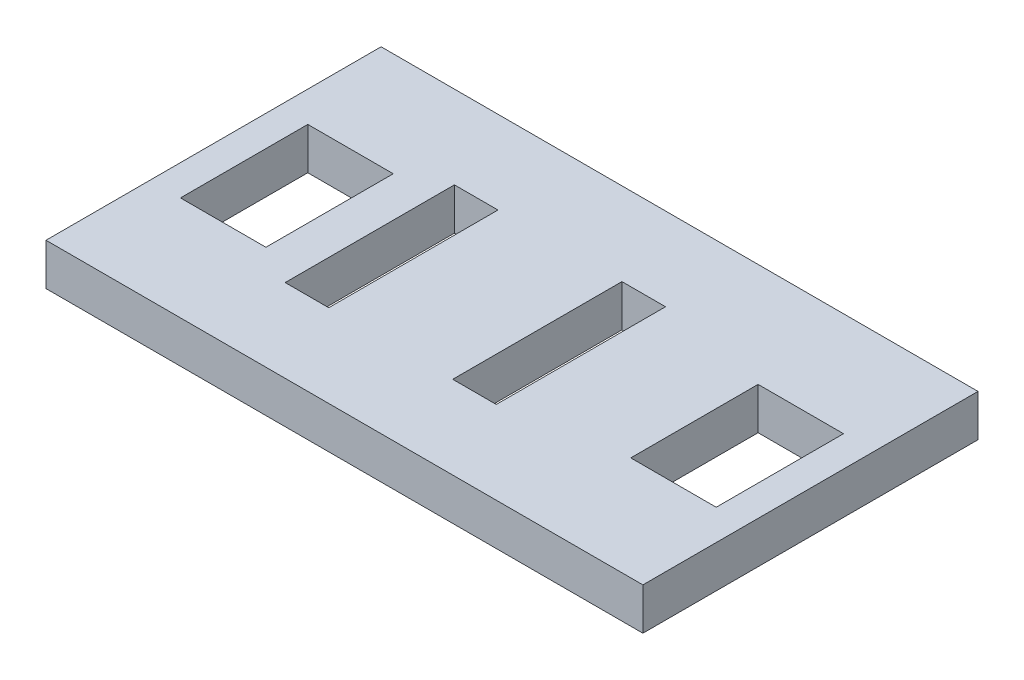
ISO-10303-21;
HEADER;
FILE_DESCRIPTION(('STEP AP214'),'2;1');
FILE_NAME('part.step','',(''),(''),'','','');
FILE_SCHEMA(('AUTOMOTIVE_DESIGN { 1 0 10303 214 1 1 1 1 }'));
ENDSEC;
DATA;
#1=APPLICATION_CONTEXT('core data for automotive mechanical design processes');
#2=APPLICATION_PROTOCOL_DEFINITION('international standard','automotive_design',2000,#1);
#3=PRODUCT_CONTEXT('',#1,'mechanical');
#4=PRODUCT('Part','Part','',(#3));
#5=PRODUCT_RELATED_PRODUCT_CATEGORY('part','',(#4));
#6=PRODUCT_DEFINITION_FORMATION('','',#4);
#7=PRODUCT_DEFINITION_CONTEXT('part definition',#1,'design');
#8=PRODUCT_DEFINITION('design','',#6,#7);
#9=PRODUCT_DEFINITION_SHAPE('','',#8);
#10=(LENGTH_UNIT() NAMED_UNIT(*) SI_UNIT(.MILLI.,.METRE.));
#11=(NAMED_UNIT(*) PLANE_ANGLE_UNIT() SI_UNIT($,.RADIAN.));
#12=(NAMED_UNIT(*) SI_UNIT($,.STERADIAN.) SOLID_ANGLE_UNIT());
#13=UNCERTAINTY_MEASURE_WITH_UNIT(LENGTH_MEASURE(1.E-05),#10,'distance_accuracy_value','');
#14=(GEOMETRIC_REPRESENTATION_CONTEXT(3) GLOBAL_UNCERTAINTY_ASSIGNED_CONTEXT((#13)) GLOBAL_UNIT_ASSIGNED_CONTEXT((#10,
#11,#12)) REPRESENTATION_CONTEXT('',''));
#15=CARTESIAN_POINT('',(0.,0.,0.));
#16=DIRECTION('',(0.,0.,1.));
#17=DIRECTION('',(1.,0.,0.));
#18=AXIS2_PLACEMENT_3D('',#15,#16,#17);
#19=CARTESIAN_POINT('',(-40.48125,6.35,25.4));
#20=DIRECTION('',(0.,0.,-1.));
#21=DIRECTION('',(-1.,0.,0.));
#22=AXIS2_PLACEMENT_3D('',#19,#20,#21);
#23=PLANE('',#22);
#24=DIRECTION('',(1.,0.,0.));
#25=VECTOR('',#24,1.);
#26=CARTESIAN_POINT('',(-40.48125,0.,25.4));
#27=LINE('',#26,#25);
#28=CARTESIAN_POINT('',(-45.24375,0.,25.4));
#29=VERTEX_POINT('',#28);
#30=CARTESIAN_POINT('',(45.24375,0.,25.4));
#31=VERTEX_POINT('',#30);
#32=EDGE_CURVE('E128',#29,#31,#27,.T.);
#33=ORIENTED_EDGE('',*,*,#32,.T.);
#34=DIRECTION('',(0.,1.,0.));
#35=VECTOR('',#34,1.);
#36=CARTESIAN_POINT('',(45.24375,-51.0227538089626,25.4));
#37=LINE('',#36,#35);
#38=CARTESIAN_POINT('',(45.24375,6.35,25.4));
#39=VERTEX_POINT('',#38);
#40=EDGE_CURVE('E124',#31,#39,#37,.T.);
#41=ORIENTED_EDGE('',*,*,#40,.T.);
#42=DIRECTION('',(1.,0.,0.));
#43=VECTOR('',#42,1.);
#44=CARTESIAN_POINT('',(-40.48125,6.35,25.4));
#45=LINE('',#44,#43);
#46=CARTESIAN_POINT('',(-45.24375,6.35,25.4));
#47=VERTEX_POINT('',#46);
#48=EDGE_CURVE('E104',#47,#39,#45,.T.);
#49=ORIENTED_EDGE('',*,*,#48,.F.);
#50=DIRECTION('',(0.,1.,0.));
#51=VECTOR('',#50,1.);
#52=CARTESIAN_POINT('',(-45.24375,-51.0227538089626,25.4));
#53=LINE('',#52,#51);
#54=EDGE_CURVE('E120',#29,#47,#53,.T.);
#55=ORIENTED_EDGE('',*,*,#54,.F.);
#56=EDGE_LOOP('',(#33,#41,#49,#55));
#57=FACE_BOUND('',#56,.T.);
#58=ADVANCED_FACE('F32',(#57),#23,.F.);
#59=CARTESIAN_POINT('',(-40.48125,6.35,-25.4));
#60=DIRECTION('',(0.,0.,1.));
#61=DIRECTION('',(1.,0.,0.));
#62=AXIS2_PLACEMENT_3D('',#59,#60,#61);
#63=PLANE('',#62);
#64=DIRECTION('',(-1.,0.,0.));
#65=VECTOR('',#64,1.);
#66=CARTESIAN_POINT('',(-40.48125,0.,-25.4));
#67=LINE('',#66,#65);
#68=CARTESIAN_POINT('',(45.24375,0.,-25.4));
#69=VERTEX_POINT('',#68);
#70=CARTESIAN_POINT('',(-45.24375,0.,-25.4));
#71=VERTEX_POINT('',#70);
#72=EDGE_CURVE('E127',#69,#71,#67,.T.);
#73=ORIENTED_EDGE('',*,*,#72,.T.);
#74=DIRECTION('',(0.,1.,0.));
#75=VECTOR('',#74,1.);
#76=CARTESIAN_POINT('',(-45.24375,-51.0227538089626,-25.4));
#77=LINE('',#76,#75);
#78=CARTESIAN_POINT('',(-45.24375,6.35,-25.4));
#79=VERTEX_POINT('',#78);
#80=EDGE_CURVE('E138',#71,#79,#77,.T.);
#81=ORIENTED_EDGE('',*,*,#80,.T.);
#82=DIRECTION('',(-1.,0.,0.));
#83=VECTOR('',#82,1.);
#84=CARTESIAN_POINT('',(-40.48125,6.35,-25.4));
#85=LINE('',#84,#83);
#86=CARTESIAN_POINT('',(45.24375,6.35,-25.4));
#87=VERTEX_POINT('',#86);
#88=EDGE_CURVE('E131',#87,#79,#85,.T.);
#89=ORIENTED_EDGE('',*,*,#88,.F.);
#90=DIRECTION('',(0.,1.,0.));
#91=VECTOR('',#90,1.);
#92=CARTESIAN_POINT('',(45.24375,-51.0227538089626,-25.4));
#93=LINE('',#92,#91);
#94=EDGE_CURVE('E119',#69,#87,#93,.T.);
#95=ORIENTED_EDGE('',*,*,#94,.F.);
#96=EDGE_LOOP('',(#73,#81,#89,#95));
#97=FACE_BOUND('',#96,.T.);
#98=ADVANCED_FACE('F342',(#97),#63,.F.);
#99=CARTESIAN_POINT('',(0.,6.35,0.));
#100=DIRECTION('',(0.,-1.,0.));
#101=DIRECTION('',(0.,0.,-1.));
#102=AXIS2_PLACEMENT_3D('',#99,#100,#101);
#103=PLANE('',#102);
#104=DIRECTION('',(0.,0.,1.));
#105=VECTOR('',#104,1.);
#106=CARTESIAN_POINT('',(-40.60825,6.35,-9.652));
#107=LINE('',#106,#105);
#108=CARTESIAN_POINT('',(-40.60825,6.35,-9.652));
#109=VERTEX_POINT('',#108);
#110=CARTESIAN_POINT('',(-40.60825,6.35,9.652));
#111=VERTEX_POINT('',#110);
#112=EDGE_CURVE('E42',#109,#111,#107,.T.);
#113=ORIENTED_EDGE('',*,*,#112,.F.);
#114=DIRECTION('',(-1.,0.,0.));
#115=VECTOR('',#114,1.);
#116=CARTESIAN_POINT('',(-40.60825,6.35,-9.652));
#117=LINE('',#116,#115);
#118=CARTESIAN_POINT('',(-27.65425,6.35,-9.652));
#119=VERTEX_POINT('',#118);
#120=EDGE_CURVE('E84',#119,#109,#117,.T.);
#121=ORIENTED_EDGE('',*,*,#120,.F.);
#122=DIRECTION('',(0.,0.,-1.));
#123=VECTOR('',#122,1.);
#124=CARTESIAN_POINT('',(-27.65425,6.35,-9.652));
#125=LINE('',#124,#123);
#126=CARTESIAN_POINT('',(-27.65425,6.35,9.652));
#127=VERTEX_POINT('',#126);
#128=EDGE_CURVE('E70',#127,#119,#125,.T.);
#129=ORIENTED_EDGE('',*,*,#128,.F.);
#130=DIRECTION('',(1.,0.,0.));
#131=VECTOR('',#130,1.);
#132=CARTESIAN_POINT('',(-40.60825,6.35,9.652));
#133=LINE('',#132,#131);
#134=EDGE_CURVE('E75',#111,#127,#133,.T.);
#135=ORIENTED_EDGE('',*,*,#134,.F.);
#136=EDGE_LOOP('',(#113,#121,#129,#135));
#137=FACE_BOUND('',#136,.T.);
#138=DIRECTION('',(0.,0.,-1.));
#139=VECTOR('',#138,1.);
#140=CARTESIAN_POINT('',(40.60825,6.35,9.652));
#141=LINE('',#140,#139);
#142=CARTESIAN_POINT('',(40.60825,6.35,9.652));
#143=VERTEX_POINT('',#142);
#144=CARTESIAN_POINT('',(40.60825,6.35,-9.652));
#145=VERTEX_POINT('',#144);
#146=EDGE_CURVE('E404',#143,#145,#141,.T.);
#147=ORIENTED_EDGE('',*,*,#146,.F.);
#148=DIRECTION('',(1.,0.,0.));
#149=VECTOR('',#148,1.);
#150=CARTESIAN_POINT('',(27.65425,6.35,9.652));
#151=LINE('',#150,#149);
#152=CARTESIAN_POINT('',(27.65425,6.35,9.652));
#153=VERTEX_POINT('',#152);
#154=EDGE_CURVE('E123',#153,#143,#151,.T.);
#155=ORIENTED_EDGE('',*,*,#154,.F.);
#156=DIRECTION('',(0.,0.,1.));
#157=VECTOR('',#156,1.);
#158=CARTESIAN_POINT('',(27.65425,6.35,9.652));
#159=LINE('',#158,#157);
#160=CARTESIAN_POINT('',(27.65425,6.35,-9.652));
#161=VERTEX_POINT('',#160);
#162=EDGE_CURVE('E412',#161,#153,#159,.T.);
#163=ORIENTED_EDGE('',*,*,#162,.F.);
#164=DIRECTION('',(-1.,0.,0.));
#165=VECTOR('',#164,1.);
#166=CARTESIAN_POINT('',(27.65425,6.35,-9.652));
#167=LINE('',#166,#165);
#168=EDGE_CURVE('E408',#145,#161,#167,.T.);
#169=ORIENTED_EDGE('',*,*,#168,.F.);
#170=EDGE_LOOP('',(#147,#155,#163,#169));
#171=FACE_BOUND('',#170,.T.);
#172=DIRECTION('',(0.,0.,-1.));
#173=VECTOR('',#172,1.);
#174=CARTESIAN_POINT('',(3.84175000000004,6.35,-12.827));
#175=LINE('',#174,#173);
#176=CARTESIAN_POINT('',(3.84175000000003,6.35,12.827));
#177=VERTEX_POINT('',#176);
#178=CARTESIAN_POINT('',(3.84175000000004,6.35,-12.827));
#179=VERTEX_POINT('',#178);
#180=EDGE_CURVE('E141',#177,#179,#175,.T.);
#181=ORIENTED_EDGE('',*,*,#180,.T.);
#182=DIRECTION('',(1.,0.,0.));
#183=VECTOR('',#182,1.);
#184=CARTESIAN_POINT('',(10.44575,6.35,-12.827));
#185=LINE('',#184,#183);
#186=CARTESIAN_POINT('',(10.44575,6.35,-12.827));
#187=VERTEX_POINT('',#186);
#188=EDGE_CURVE('E210',#179,#187,#185,.T.);
#189=ORIENTED_EDGE('',*,*,#188,.T.);
#190=DIRECTION('',(0.,0.,1.));
#191=VECTOR('',#190,1.);
#192=CARTESIAN_POINT('',(10.44575,6.35,-12.827));
#193=LINE('',#192,#191);
#194=CARTESIAN_POINT('',(10.44575,6.35,12.827));
#195=VERTEX_POINT('',#194);
#196=EDGE_CURVE('E213',#187,#195,#193,.T.);
#197=ORIENTED_EDGE('',*,*,#196,.T.);
#198=DIRECTION('',(-1.,0.,0.));
#199=VECTOR('',#198,1.);
#200=CARTESIAN_POINT('',(10.44575,6.35,12.827));
#201=LINE('',#200,#199);
#202=EDGE_CURVE('E154',#195,#177,#201,.T.);
#203=ORIENTED_EDGE('',*,*,#202,.T.);
#204=EDGE_LOOP('',(#181,#189,#197,#203));
#205=FACE_BOUND('',#204,.T.);
#206=DIRECTION('',(0.,0.,1.));
#207=VECTOR('',#206,1.);
#208=CARTESIAN_POINT('',(-14.95425,6.35,12.827));
#209=LINE('',#208,#207);
#210=CARTESIAN_POINT('',(-14.95425,6.35,-12.827));
#211=VERTEX_POINT('',#210);
#212=CARTESIAN_POINT('',(-14.95425,6.35,12.827));
#213=VERTEX_POINT('',#212);
#214=EDGE_CURVE('E146',#211,#213,#209,.T.);
#215=ORIENTED_EDGE('',*,*,#214,.T.);
#216=DIRECTION('',(-1.,0.,0.));
#217=VECTOR('',#216,1.);
#218=CARTESIAN_POINT('',(-14.95425,6.35,12.827));
#219=LINE('',#218,#217);
#220=CARTESIAN_POINT('',(-21.55825,6.35,12.827));
#221=VERTEX_POINT('',#220);
#222=EDGE_CURVE('E142',#213,#221,#219,.T.);
#223=ORIENTED_EDGE('',*,*,#222,.T.);
#224=DIRECTION('',(0.,0.,-1.));
#225=VECTOR('',#224,1.);
#226=CARTESIAN_POINT('',(-21.55825,6.35,12.827));
#227=LINE('',#226,#225);
#228=CARTESIAN_POINT('',(-21.55825,6.35,-12.827));
#229=VERTEX_POINT('',#228);
#230=EDGE_CURVE('E145',#221,#229,#227,.T.);
#231=ORIENTED_EDGE('',*,*,#230,.T.);
#232=DIRECTION('',(1.,0.,0.));
#233=VECTOR('',#232,1.);
#234=CARTESIAN_POINT('',(-14.95425,6.35,-12.827));
#235=LINE('',#234,#233);
#236=EDGE_CURVE('E149',#229,#211,#235,.T.);
#237=ORIENTED_EDGE('',*,*,#236,.T.);
#238=EDGE_LOOP('',(#215,#223,#231,#237));
#239=FACE_BOUND('',#238,.T.);
#240=ORIENTED_EDGE('',*,*,#88,.T.);
#241=DIRECTION('',(0.,0.,1.));
#242=VECTOR('',#241,1.);
#243=CARTESIAN_POINT('',(-45.24375,6.35,-25.4));
#244=LINE('',#243,#242);
#245=EDGE_CURVE('E111',#79,#47,#244,.T.);
#246=ORIENTED_EDGE('',*,*,#245,.T.);
#247=ORIENTED_EDGE('',*,*,#48,.T.);
#248=DIRECTION('',(0.,0.,-1.));
#249=VECTOR('',#248,1.);
#250=CARTESIAN_POINT('',(45.24375,6.35,25.4));
#251=LINE('',#250,#249);
#252=EDGE_CURVE('E101',#39,#87,#251,.T.);
#253=ORIENTED_EDGE('',*,*,#252,.T.);
#254=EDGE_LOOP('',(#240,#246,#247,#253));
#255=FACE_BOUND('',#254,.T.);
#256=ADVANCED_FACE('F34',(#137,#171,#205,#239,#255),#103,.F.);
#257=CARTESIAN_POINT('',(0.,0.,0.));
#258=DIRECTION('',(0.,-1.,0.));
#259=DIRECTION('',(0.,0.,-1.));
#260=AXIS2_PLACEMENT_3D('',#257,#258,#259);
#261=PLANE('',#260);
#262=DIRECTION('',(-1.,0.,0.));
#263=VECTOR('',#262,1.);
#264=CARTESIAN_POINT('',(-40.60825,0.,-9.652));
#265=LINE('',#264,#263);
#266=CARTESIAN_POINT('',(-27.65425,0.,-9.652));
#267=VERTEX_POINT('',#266);
#268=CARTESIAN_POINT('',(-40.60825,0.,-9.652));
#269=VERTEX_POINT('',#268);
#270=EDGE_CURVE('E36',#267,#269,#265,.T.);
#271=ORIENTED_EDGE('',*,*,#270,.T.);
#272=DIRECTION('',(0.,0.,1.));
#273=VECTOR('',#272,1.);
#274=CARTESIAN_POINT('',(-40.60825,0.,-9.652));
#275=LINE('',#274,#273);
#276=CARTESIAN_POINT('',(-40.60825,0.,9.652));
#277=VERTEX_POINT('',#276);
#278=EDGE_CURVE('E96',#269,#277,#275,.T.);
#279=ORIENTED_EDGE('',*,*,#278,.T.);
#280=DIRECTION('',(1.,0.,0.));
#281=VECTOR('',#280,1.);
#282=CARTESIAN_POINT('',(-40.60825,0.,9.652));
#283=LINE('',#282,#281);
#284=CARTESIAN_POINT('',(-27.65425,0.,9.652));
#285=VERTEX_POINT('',#284);
#286=EDGE_CURVE('E95',#277,#285,#283,.T.);
#287=ORIENTED_EDGE('',*,*,#286,.T.);
#288=DIRECTION('',(0.,0.,-1.));
#289=VECTOR('',#288,1.);
#290=CARTESIAN_POINT('',(-27.65425,0.,-9.652));
#291=LINE('',#290,#289);
#292=EDGE_CURVE('E73',#285,#267,#291,.T.);
#293=ORIENTED_EDGE('',*,*,#292,.T.);
#294=EDGE_LOOP('',(#271,#279,#287,#293));
#295=FACE_BOUND('',#294,.T.);
#296=DIRECTION('',(1.,0.,0.));
#297=VECTOR('',#296,1.);
#298=CARTESIAN_POINT('',(27.65425,0.,9.652));
#299=LINE('',#298,#297);
#300=CARTESIAN_POINT('',(27.65425,0.,9.652));
#301=VERTEX_POINT('',#300);
#302=CARTESIAN_POINT('',(40.60825,0.,9.652));
#303=VERTEX_POINT('',#302);
#304=EDGE_CURVE('E94',#301,#303,#299,.T.);
#305=ORIENTED_EDGE('',*,*,#304,.T.);
#306=DIRECTION('',(0.,0.,-1.));
#307=VECTOR('',#306,1.);
#308=CARTESIAN_POINT('',(40.60825,0.,9.652));
#309=LINE('',#308,#307);
#310=CARTESIAN_POINT('',(40.60825,0.,-9.652));
#311=VERTEX_POINT('',#310);
#312=EDGE_CURVE('E393',#303,#311,#309,.T.);
#313=ORIENTED_EDGE('',*,*,#312,.T.);
#314=DIRECTION('',(-1.,0.,0.));
#315=VECTOR('',#314,1.);
#316=CARTESIAN_POINT('',(27.65425,0.,-9.652));
#317=LINE('',#316,#315);
#318=CARTESIAN_POINT('',(27.65425,0.,-9.652));
#319=VERTEX_POINT('',#318);
#320=EDGE_CURVE('E397',#311,#319,#317,.T.);
#321=ORIENTED_EDGE('',*,*,#320,.T.);
#322=DIRECTION('',(0.,0.,1.));
#323=VECTOR('',#322,1.);
#324=CARTESIAN_POINT('',(27.65425,0.,9.652));
#325=LINE('',#324,#323);
#326=EDGE_CURVE('E159',#319,#301,#325,.T.);
#327=ORIENTED_EDGE('',*,*,#326,.T.);
#328=EDGE_LOOP('',(#305,#313,#321,#327));
#329=FACE_BOUND('',#328,.T.);
#330=DIRECTION('',(1.,0.,0.));
#331=VECTOR('',#330,1.);
#332=CARTESIAN_POINT('',(10.44575,0.,-12.827));
#333=LINE('',#332,#331);
#334=CARTESIAN_POINT('',(3.84175000000004,0.,-12.827));
#335=VERTEX_POINT('',#334);
#336=CARTESIAN_POINT('',(10.44575,0.,-12.827));
#337=VERTEX_POINT('',#336);
#338=EDGE_CURVE('E179',#335,#337,#333,.T.);
#339=ORIENTED_EDGE('',*,*,#338,.F.);
#340=DIRECTION('',(0.,0.,-1.));
#341=VECTOR('',#340,1.);
#342=CARTESIAN_POINT('',(3.84175000000004,0.,-12.827));
#343=LINE('',#342,#341);
#344=CARTESIAN_POINT('',(3.84175000000003,0.,12.827));
#345=VERTEX_POINT('',#344);
#346=EDGE_CURVE('E196',#345,#335,#343,.T.);
#347=ORIENTED_EDGE('',*,*,#346,.F.);
#348=DIRECTION('',(-1.,0.,0.));
#349=VECTOR('',#348,1.);
#350=CARTESIAN_POINT('',(10.44575,0.,12.827));
#351=LINE('',#350,#349);
#352=CARTESIAN_POINT('',(10.44575,0.,12.827));
#353=VERTEX_POINT('',#352);
#354=EDGE_CURVE('E192',#353,#345,#351,.T.);
#355=ORIENTED_EDGE('',*,*,#354,.F.);
#356=DIRECTION('',(0.,0.,1.));
#357=VECTOR('',#356,1.);
#358=CARTESIAN_POINT('',(10.44575,0.,-12.827));
#359=LINE('',#358,#357);
#360=EDGE_CURVE('E188',#337,#353,#359,.T.);
#361=ORIENTED_EDGE('',*,*,#360,.F.);
#362=EDGE_LOOP('',(#339,#347,#355,#361));
#363=FACE_BOUND('',#362,.T.);
#364=DIRECTION('',(-1.,0.,0.));
#365=VECTOR('',#364,1.);
#366=CARTESIAN_POINT('',(-14.95425,0.,12.827));
#367=LINE('',#366,#365);
#368=CARTESIAN_POINT('',(-14.95425,0.,12.827));
#369=VERTEX_POINT('',#368);
#370=CARTESIAN_POINT('',(-21.55825,0.,12.827));
#371=VERTEX_POINT('',#370);
#372=EDGE_CURVE('E155',#369,#371,#367,.T.);
#373=ORIENTED_EDGE('',*,*,#372,.F.);
#374=DIRECTION('',(0.,0.,1.));
#375=VECTOR('',#374,1.);
#376=CARTESIAN_POINT('',(-14.95425,0.,12.827));
#377=LINE('',#376,#375);
#378=CARTESIAN_POINT('',(-14.95425,0.,-12.827));
#379=VERTEX_POINT('',#378);
#380=EDGE_CURVE('E169',#379,#369,#377,.T.);
#381=ORIENTED_EDGE('',*,*,#380,.F.);
#382=DIRECTION('',(1.,0.,0.));
#383=VECTOR('',#382,1.);
#384=CARTESIAN_POINT('',(-14.95425,0.,-12.827));
#385=LINE('',#384,#383);
#386=CARTESIAN_POINT('',(-21.55825,0.,-12.827));
#387=VERTEX_POINT('',#386);
#388=EDGE_CURVE('E165',#387,#379,#385,.T.);
#389=ORIENTED_EDGE('',*,*,#388,.F.);
#390=DIRECTION('',(0.,0.,-1.));
#391=VECTOR('',#390,1.);
#392=CARTESIAN_POINT('',(-21.55825,0.,12.827));
#393=LINE('',#392,#391);
#394=EDGE_CURVE('E160',#371,#387,#393,.T.);
#395=ORIENTED_EDGE('',*,*,#394,.F.);
#396=EDGE_LOOP('',(#373,#381,#389,#395));
#397=FACE_BOUND('',#396,.T.);
#398=ORIENTED_EDGE('',*,*,#32,.F.);
#399=DIRECTION('',(0.,0.,1.));
#400=VECTOR('',#399,1.);
#401=CARTESIAN_POINT('',(-45.24375,0.,-25.4));
#402=LINE('',#401,#400);
#403=EDGE_CURVE('E132',#71,#29,#402,.T.);
#404=ORIENTED_EDGE('',*,*,#403,.F.);
#405=ORIENTED_EDGE('',*,*,#72,.F.);
#406=DIRECTION('',(0.,0.,-1.));
#407=VECTOR('',#406,1.);
#408=CARTESIAN_POINT('',(45.24375,0.,25.4));
#409=LINE('',#408,#407);
#410=EDGE_CURVE('E116',#31,#69,#409,.T.);
#411=ORIENTED_EDGE('',*,*,#410,.F.);
#412=EDGE_LOOP('',(#398,#404,#405,#411));
#413=FACE_BOUND('',#412,.T.);
#414=ADVANCED_FACE('F327',(#295,#329,#363,#397,#413),#261,.T.);
#415=CARTESIAN_POINT('',(-14.95425,6.35,12.827));
#416=DIRECTION('',(0.,0.,1.));
#417=DIRECTION('',(1.,0.,0.));
#418=AXIS2_PLACEMENT_3D('',#415,#416,#417);
#419=PLANE('',#418);
#420=ORIENTED_EDGE('',*,*,#372,.T.);
#421=DIRECTION('',(0.,-1.,0.));
#422=VECTOR('',#421,1.);
#423=CARTESIAN_POINT('',(-21.55825,6.35,12.827));
#424=LINE('',#423,#422);
#425=EDGE_CURVE('E163',#221,#371,#424,.T.);
#426=ORIENTED_EDGE('',*,*,#425,.F.);
#427=ORIENTED_EDGE('',*,*,#222,.F.);
#428=DIRECTION('',(0.,-1.,0.));
#429=VECTOR('',#428,1.);
#430=CARTESIAN_POINT('',(-14.95425,6.35,12.827));
#431=LINE('',#430,#429);
#432=EDGE_CURVE('E158',#213,#369,#431,.T.);
#433=ORIENTED_EDGE('',*,*,#432,.T.);
#434=EDGE_LOOP('',(#420,#426,#427,#433));
#435=FACE_BOUND('',#434,.T.);
#436=ADVANCED_FACE('F324',(#435),#419,.F.);
#437=CARTESIAN_POINT('',(-14.95425,6.35,12.827));
#438=DIRECTION('',(1.,0.,0.));
#439=DIRECTION('',(0.,0.,-1.));
#440=AXIS2_PLACEMENT_3D('',#437,#438,#439);
#441=PLANE('',#440);
#442=ORIENTED_EDGE('',*,*,#380,.T.);
#443=ORIENTED_EDGE('',*,*,#432,.F.);
#444=ORIENTED_EDGE('',*,*,#214,.F.);
#445=DIRECTION('',(0.,-1.,0.));
#446=VECTOR('',#445,1.);
#447=CARTESIAN_POINT('',(-14.95425,6.35,-12.827));
#448=LINE('',#447,#446);
#449=EDGE_CURVE('E168',#211,#379,#448,.T.);
#450=ORIENTED_EDGE('',*,*,#449,.T.);
#451=EDGE_LOOP('',(#442,#443,#444,#450));
#452=FACE_BOUND('',#451,.T.);
#453=ADVANCED_FACE('F331',(#452),#441,.F.);
#454=CARTESIAN_POINT('',(-14.95425,6.35,-12.827));
#455=DIRECTION('',(0.,0.,-1.));
#456=DIRECTION('',(-1.,0.,0.));
#457=AXIS2_PLACEMENT_3D('',#454,#455,#456);
#458=PLANE('',#457);
#459=ORIENTED_EDGE('',*,*,#388,.T.);
#460=ORIENTED_EDGE('',*,*,#449,.F.);
#461=ORIENTED_EDGE('',*,*,#236,.F.);
#462=DIRECTION('',(0.,-1.,0.));
#463=VECTOR('',#462,1.);
#464=CARTESIAN_POINT('',(-21.55825,6.35,-12.827));
#465=LINE('',#464,#463);
#466=EDGE_CURVE('E164',#229,#387,#465,.T.);
#467=ORIENTED_EDGE('',*,*,#466,.T.);
#468=EDGE_LOOP('',(#459,#460,#461,#467));
#469=FACE_BOUND('',#468,.T.);
#470=ADVANCED_FACE('F315',(#469),#458,.F.);
#471=CARTESIAN_POINT('',(-21.55825,6.35,12.827));
#472=DIRECTION('',(-1.,0.,0.));
#473=DIRECTION('',(0.,0.,1.));
#474=AXIS2_PLACEMENT_3D('',#471,#472,#473);
#475=PLANE('',#474);
#476=ORIENTED_EDGE('',*,*,#394,.T.);
#477=ORIENTED_EDGE('',*,*,#466,.F.);
#478=ORIENTED_EDGE('',*,*,#230,.F.);
#479=ORIENTED_EDGE('',*,*,#425,.T.);
#480=EDGE_LOOP('',(#476,#477,#478,#479));
#481=FACE_BOUND('',#480,.T.);
#482=ADVANCED_FACE('F319',(#481),#475,.F.);
#483=CARTESIAN_POINT('',(10.44575,6.35,-12.827));
#484=DIRECTION('',(0.,0.,-1.));
#485=DIRECTION('',(-1.,0.,0.));
#486=AXIS2_PLACEMENT_3D('',#483,#484,#485);
#487=PLANE('',#486);
#488=ORIENTED_EDGE('',*,*,#338,.T.);
#489=DIRECTION('',(0.,-1.,0.));
#490=VECTOR('',#489,1.);
#491=CARTESIAN_POINT('',(10.44575,6.35,-12.827));
#492=LINE('',#491,#490);
#493=EDGE_CURVE('E135',#187,#337,#492,.T.);
#494=ORIENTED_EDGE('',*,*,#493,.F.);
#495=ORIENTED_EDGE('',*,*,#188,.F.);
#496=DIRECTION('',(0.,-1.,0.));
#497=VECTOR('',#496,1.);
#498=CARTESIAN_POINT('',(3.84175000000004,6.35,-12.827));
#499=LINE('',#498,#497);
#500=EDGE_CURVE('E197',#179,#335,#499,.T.);
#501=ORIENTED_EDGE('',*,*,#500,.T.);
#502=EDGE_LOOP('',(#488,#494,#495,#501));
#503=FACE_BOUND('',#502,.T.);
#504=ADVANCED_FACE('F231',(#503),#487,.F.);
#505=CARTESIAN_POINT('',(3.84175000000004,6.35,-12.827));
#506=DIRECTION('',(-1.,0.,0.));
#507=DIRECTION('',(0.,0.,1.));
#508=AXIS2_PLACEMENT_3D('',#505,#506,#507);
#509=PLANE('',#508);
#510=ORIENTED_EDGE('',*,*,#346,.T.);
#511=ORIENTED_EDGE('',*,*,#500,.F.);
#512=ORIENTED_EDGE('',*,*,#180,.F.);
#513=DIRECTION('',(0.,-1.,0.));
#514=VECTOR('',#513,1.);
#515=CARTESIAN_POINT('',(3.84175000000003,6.35,12.827));
#516=LINE('',#515,#514);
#517=EDGE_CURVE('E193',#177,#345,#516,.T.);
#518=ORIENTED_EDGE('',*,*,#517,.T.);
#519=EDGE_LOOP('',(#510,#511,#512,#518));
#520=FACE_BOUND('',#519,.T.);
#521=ADVANCED_FACE('F353',(#520),#509,.F.);
#522=CARTESIAN_POINT('',(10.44575,6.35,12.827));
#523=DIRECTION('',(0.,0.,1.));
#524=DIRECTION('',(1.,0.,0.));
#525=AXIS2_PLACEMENT_3D('',#522,#523,#524);
#526=PLANE('',#525);
#527=ORIENTED_EDGE('',*,*,#354,.T.);
#528=ORIENTED_EDGE('',*,*,#517,.F.);
#529=ORIENTED_EDGE('',*,*,#202,.F.);
#530=DIRECTION('',(0.,-1.,0.));
#531=VECTOR('',#530,1.);
#532=CARTESIAN_POINT('',(10.44575,6.35,12.827));
#533=LINE('',#532,#531);
#534=EDGE_CURVE('E189',#195,#353,#533,.T.);
#535=ORIENTED_EDGE('',*,*,#534,.T.);
#536=EDGE_LOOP('',(#527,#528,#529,#535));
#537=FACE_BOUND('',#536,.T.);
#538=ADVANCED_FACE('F358',(#537),#526,.F.);
#539=CARTESIAN_POINT('',(10.44575,6.35,-12.827));
#540=DIRECTION('',(1.,0.,0.));
#541=DIRECTION('',(0.,0.,-1.));
#542=AXIS2_PLACEMENT_3D('',#539,#540,#541);
#543=PLANE('',#542);
#544=ORIENTED_EDGE('',*,*,#360,.T.);
#545=ORIENTED_EDGE('',*,*,#534,.F.);
#546=ORIENTED_EDGE('',*,*,#196,.F.);
#547=ORIENTED_EDGE('',*,*,#493,.T.);
#548=EDGE_LOOP('',(#544,#545,#546,#547));
#549=FACE_BOUND('',#548,.T.);
#550=ADVANCED_FACE('F354',(#549),#543,.F.);
#551=CARTESIAN_POINT('',(-45.24375,-51.0227538089626,-25.4));
#552=DIRECTION('',(-1.,0.,0.));
#553=DIRECTION('',(0.,0.,1.));
#554=AXIS2_PLACEMENT_3D('',#551,#552,#553);
#555=PLANE('',#554);
#556=ORIENTED_EDGE('',*,*,#80,.F.);
#557=ORIENTED_EDGE('',*,*,#403,.T.);
#558=ORIENTED_EDGE('',*,*,#54,.T.);
#559=ORIENTED_EDGE('',*,*,#245,.F.);
#560=EDGE_LOOP('',(#556,#557,#558,#559));
#561=FACE_BOUND('',#560,.T.);
#562=ADVANCED_FACE('F357',(#561),#555,.T.);
#563=CARTESIAN_POINT('',(45.24375,-51.0227538089626,25.4));
#564=DIRECTION('',(1.,0.,0.));
#565=DIRECTION('',(0.,0.,-1.));
#566=AXIS2_PLACEMENT_3D('',#563,#564,#565);
#567=PLANE('',#566);
#568=ORIENTED_EDGE('',*,*,#40,.F.);
#569=ORIENTED_EDGE('',*,*,#410,.T.);
#570=ORIENTED_EDGE('',*,*,#94,.T.);
#571=ORIENTED_EDGE('',*,*,#252,.F.);
#572=EDGE_LOOP('',(#568,#569,#570,#571));
#573=FACE_BOUND('',#572,.T.);
#574=ADVANCED_FACE('F429',(#573),#567,.T.);
#575=CARTESIAN_POINT('',(27.65425,0.,9.652));
#576=DIRECTION('',(0.,0.,1.));
#577=DIRECTION('',(1.,0.,0.));
#578=AXIS2_PLACEMENT_3D('',#575,#576,#577);
#579=PLANE('',#578);
#580=ORIENTED_EDGE('',*,*,#154,.T.);
#581=DIRECTION('',(0.,1.,0.));
#582=VECTOR('',#581,1.);
#583=CARTESIAN_POINT('',(40.60825,0.,9.652));
#584=LINE('',#583,#582);
#585=EDGE_CURVE('E92',#303,#143,#584,.T.);
#586=ORIENTED_EDGE('',*,*,#585,.F.);
#587=ORIENTED_EDGE('',*,*,#304,.F.);
#588=DIRECTION('',(0.,1.,0.));
#589=VECTOR('',#588,1.);
#590=CARTESIAN_POINT('',(27.65425,0.,9.652));
#591=LINE('',#590,#589);
#592=EDGE_CURVE('E403',#301,#153,#591,.T.);
#593=ORIENTED_EDGE('',*,*,#592,.T.);
#594=EDGE_LOOP('',(#580,#586,#587,#593));
#595=FACE_BOUND('',#594,.T.);
#596=ADVANCED_FACE('F427',(#595),#579,.F.);
#597=CARTESIAN_POINT('',(27.65425,0.,9.652));
#598=DIRECTION('',(-1.,0.,0.));
#599=DIRECTION('',(0.,0.,1.));
#600=AXIS2_PLACEMENT_3D('',#597,#598,#599);
#601=PLANE('',#600);
#602=ORIENTED_EDGE('',*,*,#162,.T.);
#603=ORIENTED_EDGE('',*,*,#592,.F.);
#604=ORIENTED_EDGE('',*,*,#326,.F.);
#605=DIRECTION('',(0.,1.,0.));
#606=VECTOR('',#605,1.);
#607=CARTESIAN_POINT('',(27.65425,0.,-9.652));
#608=LINE('',#607,#606);
#609=EDGE_CURVE('E411',#319,#161,#608,.T.);
#610=ORIENTED_EDGE('',*,*,#609,.T.);
#611=EDGE_LOOP('',(#602,#603,#604,#610));
#612=FACE_BOUND('',#611,.T.);
#613=ADVANCED_FACE('F426',(#612),#601,.F.);
#614=CARTESIAN_POINT('',(27.65425,0.,-9.652));
#615=DIRECTION('',(0.,0.,-1.));
#616=DIRECTION('',(-1.,0.,0.));
#617=AXIS2_PLACEMENT_3D('',#614,#615,#616);
#618=PLANE('',#617);
#619=ORIENTED_EDGE('',*,*,#168,.T.);
#620=ORIENTED_EDGE('',*,*,#609,.F.);
#621=ORIENTED_EDGE('',*,*,#320,.F.);
#622=DIRECTION('',(0.,1.,0.));
#623=VECTOR('',#622,1.);
#624=CARTESIAN_POINT('',(40.60825,0.,-9.652));
#625=LINE('',#624,#623);
#626=EDGE_CURVE('E407',#311,#145,#625,.T.);
#627=ORIENTED_EDGE('',*,*,#626,.T.);
#628=EDGE_LOOP('',(#619,#620,#621,#627));
#629=FACE_BOUND('',#628,.T.);
#630=ADVANCED_FACE('F418',(#629),#618,.F.);
#631=CARTESIAN_POINT('',(40.60825,0.,9.652));
#632=DIRECTION('',(1.,0.,0.));
#633=DIRECTION('',(0.,0.,-1.));
#634=AXIS2_PLACEMENT_3D('',#631,#632,#633);
#635=PLANE('',#634);
#636=ORIENTED_EDGE('',*,*,#146,.T.);
#637=ORIENTED_EDGE('',*,*,#626,.F.);
#638=ORIENTED_EDGE('',*,*,#312,.F.);
#639=ORIENTED_EDGE('',*,*,#585,.T.);
#640=EDGE_LOOP('',(#636,#637,#638,#639));
#641=FACE_BOUND('',#640,.T.);
#642=ADVANCED_FACE('F368',(#641),#635,.F.);
#643=CARTESIAN_POINT('',(-40.60825,0.,-9.652));
#644=DIRECTION('',(0.,0.,-1.));
#645=DIRECTION('',(-1.,0.,0.));
#646=AXIS2_PLACEMENT_3D('',#643,#644,#645);
#647=PLANE('',#646);
#648=ORIENTED_EDGE('',*,*,#120,.T.);
#649=DIRECTION('',(0.,1.,0.));
#650=VECTOR('',#649,1.);
#651=CARTESIAN_POINT('',(-40.60825,0.,-9.652));
#652=LINE('',#651,#650);
#653=EDGE_CURVE('E11',#269,#109,#652,.T.);
#654=ORIENTED_EDGE('',*,*,#653,.F.);
#655=ORIENTED_EDGE('',*,*,#270,.F.);
#656=DIRECTION('',(0.,1.,0.));
#657=VECTOR('',#656,1.);
#658=CARTESIAN_POINT('',(-27.65425,0.,-9.652));
#659=LINE('',#658,#657);
#660=EDGE_CURVE('E85',#267,#119,#659,.T.);
#661=ORIENTED_EDGE('',*,*,#660,.T.);
#662=EDGE_LOOP('',(#648,#654,#655,#661));
#663=FACE_BOUND('',#662,.T.);
#664=ADVANCED_FACE('F365',(#663),#647,.F.);
#665=CARTESIAN_POINT('',(-27.65425,0.,-9.652));
#666=DIRECTION('',(1.,0.,0.));
#667=DIRECTION('',(0.,0.,-1.));
#668=AXIS2_PLACEMENT_3D('',#665,#666,#667);
#669=PLANE('',#668);
#670=ORIENTED_EDGE('',*,*,#128,.T.);
#671=ORIENTED_EDGE('',*,*,#660,.F.);
#672=ORIENTED_EDGE('',*,*,#292,.F.);
#673=DIRECTION('',(0.,1.,0.));
#674=VECTOR('',#673,1.);
#675=CARTESIAN_POINT('',(-27.65425,0.,9.652));
#676=LINE('',#675,#674);
#677=EDGE_CURVE('E64',#285,#127,#676,.T.);
#678=ORIENTED_EDGE('',*,*,#677,.T.);
#679=EDGE_LOOP('',(#670,#671,#672,#678));
#680=FACE_BOUND('',#679,.T.);
#681=ADVANCED_FACE('F68',(#680),#669,.F.);
#682=CARTESIAN_POINT('',(-40.60825,0.,9.652));
#683=DIRECTION('',(0.,0.,1.));
#684=DIRECTION('',(1.,0.,0.));
#685=AXIS2_PLACEMENT_3D('',#682,#683,#684);
#686=PLANE('',#685);
#687=ORIENTED_EDGE('',*,*,#134,.T.);
#688=ORIENTED_EDGE('',*,*,#677,.F.);
#689=ORIENTED_EDGE('',*,*,#286,.F.);
#690=DIRECTION('',(0.,1.,0.));
#691=VECTOR('',#690,1.);
#692=CARTESIAN_POINT('',(-40.60825,0.,9.652));
#693=LINE('',#692,#691);
#694=EDGE_CURVE('E51',#277,#111,#693,.T.);
#695=ORIENTED_EDGE('',*,*,#694,.T.);
#696=EDGE_LOOP('',(#687,#688,#689,#695));
#697=FACE_BOUND('',#696,.T.);
#698=ADVANCED_FACE('F78',(#697),#686,.F.);
#699=CARTESIAN_POINT('',(-40.60825,0.,-9.652));
#700=DIRECTION('',(-1.,0.,0.));
#701=DIRECTION('',(0.,0.,1.));
#702=AXIS2_PLACEMENT_3D('',#699,#700,#701);
#703=PLANE('',#702);
#704=ORIENTED_EDGE('',*,*,#112,.T.);
#705=ORIENTED_EDGE('',*,*,#694,.F.);
#706=ORIENTED_EDGE('',*,*,#278,.F.);
#707=ORIENTED_EDGE('',*,*,#653,.T.);
#708=EDGE_LOOP('',(#704,#705,#706,#707));
#709=FACE_BOUND('',#708,.T.);
#710=ADVANCED_FACE('F369',(#709),#703,.F.);
#711=CLOSED_SHELL('',(#58,#98,#256,#414,#436,#453,#470,#482,#504,#521,#538,#550,#562,#574,#596,
#613,#630,#642,#664,#681,#698,#710));
#712=MANIFOLD_SOLID_BREP('B2',#711);
#713=ADVANCED_BREP_SHAPE_REPRESENTATION('',(#18,#712),#14);
#714=SHAPE_DEFINITION_REPRESENTATION(#9,#713);
ENDSEC;
END-ISO-10303-21;
